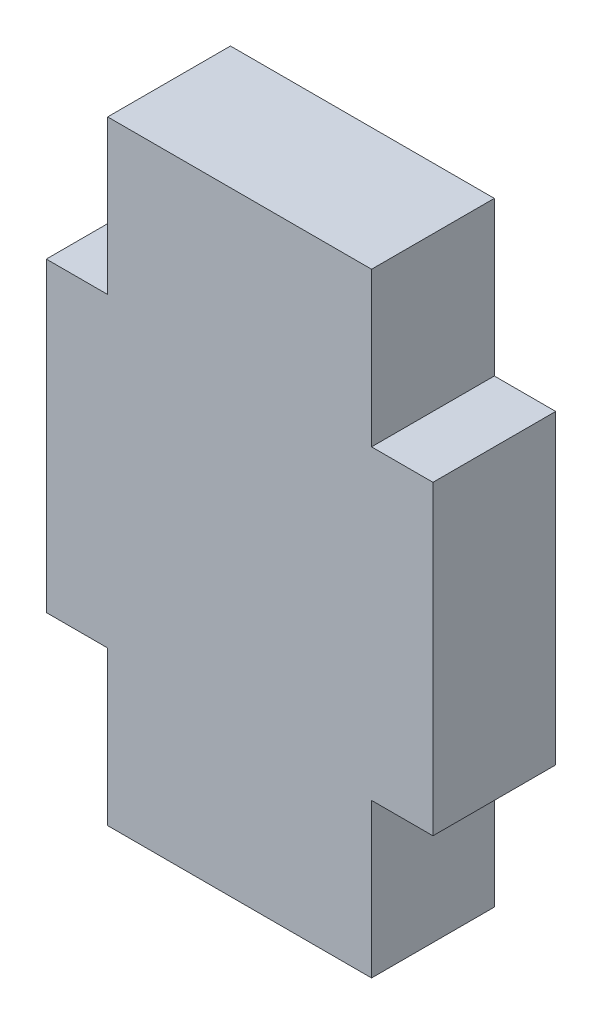
ISO-10303-21;
HEADER;
FILE_DESCRIPTION(('STEP AP214'),'2;1');
FILE_NAME('part.step','',(''),(''),'','','');
FILE_SCHEMA(('AUTOMOTIVE_DESIGN { 1 0 10303 214 1 1 1 1 }'));
ENDSEC;
DATA;
#1=APPLICATION_CONTEXT('core data for automotive mechanical design processes');
#2=APPLICATION_PROTOCOL_DEFINITION('international standard','automotive_design',2000,#1);
#3=PRODUCT_CONTEXT('',#1,'mechanical');
#4=PRODUCT('Part','Part','',(#3));
#5=PRODUCT_RELATED_PRODUCT_CATEGORY('part','',(#4));
#6=PRODUCT_DEFINITION_FORMATION('','',#4);
#7=PRODUCT_DEFINITION_CONTEXT('part definition',#1,'design');
#8=PRODUCT_DEFINITION('design','',#6,#7);
#9=PRODUCT_DEFINITION_SHAPE('','',#8);
#10=(LENGTH_UNIT() NAMED_UNIT(*) SI_UNIT(.MILLI.,.METRE.));
#11=(NAMED_UNIT(*) PLANE_ANGLE_UNIT() SI_UNIT($,.RADIAN.));
#12=(NAMED_UNIT(*) SI_UNIT($,.STERADIAN.) SOLID_ANGLE_UNIT());
#13=UNCERTAINTY_MEASURE_WITH_UNIT(LENGTH_MEASURE(1.E-05),#10,'distance_accuracy_value','');
#14=(GEOMETRIC_REPRESENTATION_CONTEXT(3) GLOBAL_UNCERTAINTY_ASSIGNED_CONTEXT((#13)) GLOBAL_UNIT_ASSIGNED_CONTEXT((#10,
#11,#12)) REPRESENTATION_CONTEXT('',''));
#15=CARTESIAN_POINT('',(0.,0.,0.));
#16=DIRECTION('',(0.,0.,1.));
#17=DIRECTION('',(1.,0.,0.));
#18=AXIS2_PLACEMENT_3D('',#15,#16,#17);
#19=CARTESIAN_POINT('',(-17.524,80.0070946012342,5.08));
#20=DIRECTION('',(1.,0.,0.));
#21=DIRECTION('',(0.,0.,-1.));
#22=AXIS2_PLACEMENT_3D('',#19,#20,#21);
#23=PLANE('',#22);
#24=DIRECTION('',(0.,-1.,0.));
#25=VECTOR('',#24,1.);
#26=CARTESIAN_POINT('',(-17.524,80.0070946012342,0.));
#27=LINE('',#26,#25);
#28=CARTESIAN_POINT('',(-17.524,80.0070946012342,0.));
#29=VERTEX_POINT('',#28);
#30=CARTESIAN_POINT('',(-17.524,73.6414919451062,0.));
#31=VERTEX_POINT('',#30);
#32=EDGE_CURVE('E153',#29,#31,#27,.T.);
#33=ORIENTED_EDGE('',*,*,#32,.T.);
#34=DIRECTION('',(0.,0.,-1.));
#35=VECTOR('',#34,1.);
#36=CARTESIAN_POINT('',(-17.524,73.6414919451062,5.08));
#37=LINE('',#36,#35);
#38=CARTESIAN_POINT('',(-17.524,73.6414919451062,5.08));
#39=VERTEX_POINT('',#38);
#40=EDGE_CURVE('E11',#39,#31,#37,.T.);
#41=ORIENTED_EDGE('',*,*,#40,.F.);
#42=DIRECTION('',(0.,-1.,0.));
#43=VECTOR('',#42,1.);
#44=CARTESIAN_POINT('',(-17.524,80.0070946012342,5.08));
#45=LINE('',#44,#43);
#46=CARTESIAN_POINT('',(-17.524,80.0070946012342,5.08));
#47=VERTEX_POINT('',#46);
#48=EDGE_CURVE('E175',#47,#39,#45,.T.);
#49=ORIENTED_EDGE('',*,*,#48,.F.);
#50=DIRECTION('',(0.,0.,-1.));
#51=VECTOR('',#50,1.);
#52=CARTESIAN_POINT('',(-17.524,80.0070946012342,5.08));
#53=LINE('',#52,#51);
#54=EDGE_CURVE('E149',#47,#29,#53,.T.);
#55=ORIENTED_EDGE('',*,*,#54,.T.);
#56=EDGE_LOOP('',(#33,#41,#49,#55));
#57=FACE_BOUND('',#56,.T.);
#58=ADVANCED_FACE('F33',(#57),#23,.F.);
#59=CARTESIAN_POINT('',(-17.524,73.6414919451062,5.08));
#60=DIRECTION('',(0.,1.,0.));
#61=DIRECTION('',(0.,0.,1.));
#62=AXIS2_PLACEMENT_3D('',#59,#60,#61);
#63=PLANE('',#62);
#64=DIRECTION('',(1.,0.,0.));
#65=VECTOR('',#64,1.);
#66=CARTESIAN_POINT('',(-17.524,73.6414919451062,0.));
#67=LINE('',#66,#65);
#68=CARTESIAN_POINT('',(-6.604,73.6414919451062,0.));
#69=VERTEX_POINT('',#68);
#70=EDGE_CURVE('E156',#31,#69,#67,.T.);
#71=ORIENTED_EDGE('',*,*,#70,.T.);
#72=DIRECTION('',(0.,0.,-1.));
#73=VECTOR('',#72,1.);
#74=CARTESIAN_POINT('',(-6.604,73.6414919451062,5.08));
#75=LINE('',#74,#73);
#76=CARTESIAN_POINT('',(-6.604,73.6414919451062,5.08));
#77=VERTEX_POINT('',#76);
#78=EDGE_CURVE('E41',#77,#69,#75,.T.);
#79=ORIENTED_EDGE('',*,*,#78,.F.);
#80=DIRECTION('',(1.,0.,0.));
#81=VECTOR('',#80,1.);
#82=CARTESIAN_POINT('',(-17.524,73.6414919451062,5.08));
#83=LINE('',#82,#81);
#84=EDGE_CURVE('E104',#39,#77,#83,.T.);
#85=ORIENTED_EDGE('',*,*,#84,.F.);
#86=ORIENTED_EDGE('',*,*,#40,.T.);
#87=EDGE_LOOP('',(#71,#79,#85,#86));
#88=FACE_BOUND('',#87,.T.);
#89=ADVANCED_FACE('F253',(#88),#63,.F.);
#90=CARTESIAN_POINT('',(-6.604,73.6414919451062,5.08));
#91=DIRECTION('',(-1.,0.,0.));
#92=DIRECTION('',(0.,0.,1.));
#93=AXIS2_PLACEMENT_3D('',#90,#91,#92);
#94=PLANE('',#93);
#95=DIRECTION('',(0.,1.,0.));
#96=VECTOR('',#95,1.);
#97=CARTESIAN_POINT('',(-6.604,73.6414919451062,0.));
#98=LINE('',#97,#96);
#99=CARTESIAN_POINT('',(-6.604,80.0070946012342,0.));
#100=VERTEX_POINT('',#99);
#101=EDGE_CURVE('E158',#69,#100,#98,.T.);
#102=ORIENTED_EDGE('',*,*,#101,.T.);
#103=DIRECTION('',(0.,0.,-1.));
#104=VECTOR('',#103,1.);
#105=CARTESIAN_POINT('',(-6.604,80.0070946012342,5.08));
#106=LINE('',#105,#104);
#107=CARTESIAN_POINT('',(-6.604,80.0070946012342,5.08));
#108=VERTEX_POINT('',#107);
#109=EDGE_CURVE('E194',#108,#100,#106,.T.);
#110=ORIENTED_EDGE('',*,*,#109,.F.);
#111=DIRECTION('',(0.,1.,0.));
#112=VECTOR('',#111,1.);
#113=CARTESIAN_POINT('',(-6.604,73.6414919451062,5.08));
#114=LINE('',#113,#112);
#115=EDGE_CURVE('E202',#77,#108,#114,.T.);
#116=ORIENTED_EDGE('',*,*,#115,.F.);
#117=ORIENTED_EDGE('',*,*,#78,.T.);
#118=EDGE_LOOP('',(#102,#110,#116,#117));
#119=FACE_BOUND('',#118,.T.);
#120=ADVANCED_FACE('F200',(#119),#94,.F.);
#121=CARTESIAN_POINT('',(-6.604,80.0070946012342,5.08));
#122=DIRECTION('',(0.,1.,0.));
#123=DIRECTION('',(0.,0.,1.));
#124=AXIS2_PLACEMENT_3D('',#121,#122,#123);
#125=PLANE('',#124);
#126=DIRECTION('',(1.,0.,0.));
#127=VECTOR('',#126,1.);
#128=CARTESIAN_POINT('',(-6.604,80.0070946012342,0.));
#129=LINE('',#128,#127);
#130=CARTESIAN_POINT('',(-4.064,80.0070946012342,0.));
#131=VERTEX_POINT('',#130);
#132=EDGE_CURVE('E160',#100,#131,#129,.T.);
#133=ORIENTED_EDGE('',*,*,#132,.T.);
#134=DIRECTION('',(0.,0.,-1.));
#135=VECTOR('',#134,1.);
#136=CARTESIAN_POINT('',(-4.064,80.0070946012342,5.08));
#137=LINE('',#136,#135);
#138=CARTESIAN_POINT('',(-4.064,80.0070946012342,5.08));
#139=VERTEX_POINT('',#138);
#140=EDGE_CURVE('E191',#139,#131,#137,.T.);
#141=ORIENTED_EDGE('',*,*,#140,.F.);
#142=DIRECTION('',(1.,0.,0.));
#143=VECTOR('',#142,1.);
#144=CARTESIAN_POINT('',(-6.604,80.0070946012342,5.08));
#145=LINE('',#144,#143);
#146=EDGE_CURVE('E220',#108,#139,#145,.T.);
#147=ORIENTED_EDGE('',*,*,#146,.F.);
#148=ORIENTED_EDGE('',*,*,#109,.T.);
#149=EDGE_LOOP('',(#133,#141,#147,#148));
#150=FACE_BOUND('',#149,.T.);
#151=ADVANCED_FACE('F211',(#150),#125,.F.);
#152=CARTESIAN_POINT('',(-4.064,80.0070946012342,5.08));
#153=DIRECTION('',(-1.,0.,0.));
#154=DIRECTION('',(0.,0.,1.));
#155=AXIS2_PLACEMENT_3D('',#152,#153,#154);
#156=PLANE('',#155);
#157=DIRECTION('',(0.,1.,0.));
#158=VECTOR('',#157,1.);
#159=CARTESIAN_POINT('',(-4.064,80.0070946012342,0.));
#160=LINE('',#159,#158);
#161=CARTESIAN_POINT('',(-4.064,92.6758892889782,0.));
#162=VERTEX_POINT('',#161);
#163=EDGE_CURVE('E162',#131,#162,#160,.T.);
#164=ORIENTED_EDGE('',*,*,#163,.T.);
#165=DIRECTION('',(0.,0.,-1.));
#166=VECTOR('',#165,1.);
#167=CARTESIAN_POINT('',(-4.064,92.6758892889782,5.08));
#168=LINE('',#167,#166);
#169=CARTESIAN_POINT('',(-4.064,92.6758892889782,5.08));
#170=VERTEX_POINT('',#169);
#171=EDGE_CURVE('E188',#170,#162,#168,.T.);
#172=ORIENTED_EDGE('',*,*,#171,.F.);
#173=DIRECTION('',(0.,1.,0.));
#174=VECTOR('',#173,1.);
#175=CARTESIAN_POINT('',(-4.064,80.0070946012342,5.08));
#176=LINE('',#175,#174);
#177=EDGE_CURVE('E217',#139,#170,#176,.T.);
#178=ORIENTED_EDGE('',*,*,#177,.F.);
#179=ORIENTED_EDGE('',*,*,#140,.T.);
#180=EDGE_LOOP('',(#164,#172,#178,#179));
#181=FACE_BOUND('',#180,.T.);
#182=ADVANCED_FACE('F215',(#181),#156,.F.);
#183=CARTESIAN_POINT('',(-6.604,92.6758892889782,5.08));
#184=DIRECTION('',(0.,-1.,0.));
#185=DIRECTION('',(0.,0.,-1.));
#186=AXIS2_PLACEMENT_3D('',#183,#184,#185);
#187=PLANE('',#186);
#188=DIRECTION('',(-1.,0.,0.));
#189=VECTOR('',#188,1.);
#190=CARTESIAN_POINT('',(-6.604,92.6758892889782,0.));
#191=LINE('',#190,#189);
#192=CARTESIAN_POINT('',(-6.604,92.6758892889782,0.));
#193=VERTEX_POINT('',#192);
#194=EDGE_CURVE('E164',#162,#193,#191,.T.);
#195=ORIENTED_EDGE('',*,*,#194,.T.);
#196=DIRECTION('',(0.,0.,-1.));
#197=VECTOR('',#196,1.);
#198=CARTESIAN_POINT('',(-6.604,92.6758892889782,5.08));
#199=LINE('',#198,#197);
#200=CARTESIAN_POINT('',(-6.604,92.6758892889782,5.08));
#201=VERTEX_POINT('',#200);
#202=EDGE_CURVE('E185',#201,#193,#199,.T.);
#203=ORIENTED_EDGE('',*,*,#202,.F.);
#204=DIRECTION('',(-1.,0.,0.));
#205=VECTOR('',#204,1.);
#206=CARTESIAN_POINT('',(-6.604,92.6758892889782,5.08));
#207=LINE('',#206,#205);
#208=EDGE_CURVE('E219',#170,#201,#207,.T.);
#209=ORIENTED_EDGE('',*,*,#208,.F.);
#210=ORIENTED_EDGE('',*,*,#171,.T.);
#211=EDGE_LOOP('',(#195,#203,#209,#210));
#212=FACE_BOUND('',#211,.T.);
#213=ADVANCED_FACE('F266',(#212),#187,.F.);
#214=CARTESIAN_POINT('',(-6.604,92.6758892889782,5.08));
#215=DIRECTION('',(-1.,0.,0.));
#216=DIRECTION('',(0.,0.,1.));
#217=AXIS2_PLACEMENT_3D('',#214,#215,#216);
#218=PLANE('',#217);
#219=DIRECTION('',(0.,1.,0.));
#220=VECTOR('',#219,1.);
#221=CARTESIAN_POINT('',(-6.604,92.6758892889782,0.));
#222=LINE('',#221,#220);
#223=CARTESIAN_POINT('',(-6.604,99.0414919451063,0.));
#224=VERTEX_POINT('',#223);
#225=EDGE_CURVE('E166',#193,#224,#222,.T.);
#226=ORIENTED_EDGE('',*,*,#225,.T.);
#227=DIRECTION('',(0.,0.,-1.));
#228=VECTOR('',#227,1.);
#229=CARTESIAN_POINT('',(-6.604,99.0414919451063,5.08));
#230=LINE('',#229,#228);
#231=CARTESIAN_POINT('',(-6.604,99.0414919451063,5.08));
#232=VERTEX_POINT('',#231);
#233=EDGE_CURVE('E182',#232,#224,#230,.T.);
#234=ORIENTED_EDGE('',*,*,#233,.F.);
#235=DIRECTION('',(0.,1.,0.));
#236=VECTOR('',#235,1.);
#237=CARTESIAN_POINT('',(-6.604,92.6758892889782,5.08));
#238=LINE('',#237,#236);
#239=EDGE_CURVE('E222',#201,#232,#238,.T.);
#240=ORIENTED_EDGE('',*,*,#239,.F.);
#241=ORIENTED_EDGE('',*,*,#202,.T.);
#242=EDGE_LOOP('',(#226,#234,#240,#241));
#243=FACE_BOUND('',#242,.T.);
#244=ADVANCED_FACE('F269',(#243),#218,.F.);
#245=CARTESIAN_POINT('',(-17.524,99.0414919451063,5.08));
#246=DIRECTION('',(0.,-1.,0.));
#247=DIRECTION('',(0.,0.,-1.));
#248=AXIS2_PLACEMENT_3D('',#245,#246,#247);
#249=PLANE('',#248);
#250=DIRECTION('',(-1.,0.,0.));
#251=VECTOR('',#250,1.);
#252=CARTESIAN_POINT('',(-17.524,99.0414919451063,0.));
#253=LINE('',#252,#251);
#254=CARTESIAN_POINT('',(-17.524,99.0414919451063,0.));
#255=VERTEX_POINT('',#254);
#256=EDGE_CURVE('E168',#224,#255,#253,.T.);
#257=ORIENTED_EDGE('',*,*,#256,.T.);
#258=DIRECTION('',(0.,0.,-1.));
#259=VECTOR('',#258,1.);
#260=CARTESIAN_POINT('',(-17.524,99.0414919451063,5.08));
#261=LINE('',#260,#259);
#262=CARTESIAN_POINT('',(-17.524,99.0414919451063,5.08));
#263=VERTEX_POINT('',#262);
#264=EDGE_CURVE('E179',#263,#255,#261,.T.);
#265=ORIENTED_EDGE('',*,*,#264,.F.);
#266=DIRECTION('',(-1.,0.,0.));
#267=VECTOR('',#266,1.);
#268=CARTESIAN_POINT('',(-17.524,99.0414919451063,5.08));
#269=LINE('',#268,#267);
#270=EDGE_CURVE('E228',#232,#263,#269,.T.);
#271=ORIENTED_EDGE('',*,*,#270,.F.);
#272=ORIENTED_EDGE('',*,*,#233,.T.);
#273=EDGE_LOOP('',(#257,#265,#271,#272));
#274=FACE_BOUND('',#273,.T.);
#275=ADVANCED_FACE('F234',(#274),#249,.F.);
#276=CARTESIAN_POINT('',(-17.524,99.0414919451063,5.08));
#277=DIRECTION('',(1.,0.,0.));
#278=DIRECTION('',(0.,0.,-1.));
#279=AXIS2_PLACEMENT_3D('',#276,#277,#278);
#280=PLANE('',#279);
#281=DIRECTION('',(0.,-1.,0.));
#282=VECTOR('',#281,1.);
#283=CARTESIAN_POINT('',(-17.524,99.0414919451063,0.));
#284=LINE('',#283,#282);
#285=CARTESIAN_POINT('',(-17.524,92.6758892889782,0.));
#286=VERTEX_POINT('',#285);
#287=EDGE_CURVE('E170',#255,#286,#284,.T.);
#288=ORIENTED_EDGE('',*,*,#287,.T.);
#289=DIRECTION('',(0.,0.,-1.));
#290=VECTOR('',#289,1.);
#291=CARTESIAN_POINT('',(-17.524,92.6758892889782,5.08));
#292=LINE('',#291,#290);
#293=CARTESIAN_POINT('',(-17.524,92.6758892889782,5.08));
#294=VERTEX_POINT('',#293);
#295=EDGE_CURVE('E144',#294,#286,#292,.T.);
#296=ORIENTED_EDGE('',*,*,#295,.F.);
#297=DIRECTION('',(0.,-1.,0.));
#298=VECTOR('',#297,1.);
#299=CARTESIAN_POINT('',(-17.524,99.0414919451063,5.08));
#300=LINE('',#299,#298);
#301=EDGE_CURVE('E135',#263,#294,#300,.T.);
#302=ORIENTED_EDGE('',*,*,#301,.F.);
#303=ORIENTED_EDGE('',*,*,#264,.T.);
#304=EDGE_LOOP('',(#288,#296,#302,#303));
#305=FACE_BOUND('',#304,.T.);
#306=ADVANCED_FACE('F238',(#305),#280,.F.);
#307=CARTESIAN_POINT('',(-17.524,92.6758892889782,5.08));
#308=DIRECTION('',(0.,-1.,0.));
#309=DIRECTION('',(0.,0.,-1.));
#310=AXIS2_PLACEMENT_3D('',#307,#308,#309);
#311=PLANE('',#310);
#312=DIRECTION('',(-1.,0.,0.));
#313=VECTOR('',#312,1.);
#314=CARTESIAN_POINT('',(-17.524,92.6758892889782,0.));
#315=LINE('',#314,#313);
#316=CARTESIAN_POINT('',(-20.064,92.6758892889782,0.));
#317=VERTEX_POINT('',#316);
#318=EDGE_CURVE('E143',#286,#317,#315,.T.);
#319=ORIENTED_EDGE('',*,*,#318,.T.);
#320=DIRECTION('',(0.,0.,-1.));
#321=VECTOR('',#320,1.);
#322=CARTESIAN_POINT('',(-20.064,92.6758892889782,5.08));
#323=LINE('',#322,#321);
#324=CARTESIAN_POINT('',(-20.064,92.6758892889782,5.08));
#325=VERTEX_POINT('',#324);
#326=EDGE_CURVE('E140',#325,#317,#323,.T.);
#327=ORIENTED_EDGE('',*,*,#326,.F.);
#328=DIRECTION('',(-1.,0.,0.));
#329=VECTOR('',#328,1.);
#330=CARTESIAN_POINT('',(-17.524,92.6758892889782,5.08));
#331=LINE('',#330,#329);
#332=EDGE_CURVE('E129',#294,#325,#331,.T.);
#333=ORIENTED_EDGE('',*,*,#332,.F.);
#334=ORIENTED_EDGE('',*,*,#295,.T.);
#335=EDGE_LOOP('',(#319,#327,#333,#334));
#336=FACE_BOUND('',#335,.T.);
#337=ADVANCED_FACE('F141',(#336),#311,.F.);
#338=CARTESIAN_POINT('',(-20.064,92.6758892889782,5.08));
#339=DIRECTION('',(1.,0.,0.));
#340=DIRECTION('',(0.,0.,-1.));
#341=AXIS2_PLACEMENT_3D('',#338,#339,#340);
#342=PLANE('',#341);
#343=DIRECTION('',(0.,-1.,0.));
#344=VECTOR('',#343,1.);
#345=CARTESIAN_POINT('',(-20.064,92.6758892889782,0.));
#346=LINE('',#345,#344);
#347=CARTESIAN_POINT('',(-20.064,80.0070946012342,0.));
#348=VERTEX_POINT('',#347);
#349=EDGE_CURVE('E90',#317,#348,#346,.T.);
#350=ORIENTED_EDGE('',*,*,#349,.T.);
#351=DIRECTION('',(0.,0.,-1.));
#352=VECTOR('',#351,1.);
#353=CARTESIAN_POINT('',(-20.064,80.0070946012342,5.08));
#354=LINE('',#353,#352);
#355=CARTESIAN_POINT('',(-20.064,80.0070946012342,5.08));
#356=VERTEX_POINT('',#355);
#357=EDGE_CURVE('E145',#356,#348,#354,.T.);
#358=ORIENTED_EDGE('',*,*,#357,.F.);
#359=DIRECTION('',(0.,-1.,0.));
#360=VECTOR('',#359,1.);
#361=CARTESIAN_POINT('',(-20.064,92.6758892889782,5.08));
#362=LINE('',#361,#360);
#363=EDGE_CURVE('E133',#325,#356,#362,.T.);
#364=ORIENTED_EDGE('',*,*,#363,.F.);
#365=ORIENTED_EDGE('',*,*,#326,.T.);
#366=EDGE_LOOP('',(#350,#358,#364,#365));
#367=FACE_BOUND('',#366,.T.);
#368=ADVANCED_FACE('F147',(#367),#342,.F.);
#369=CARTESIAN_POINT('',(-17.524,80.0070946012342,5.08));
#370=DIRECTION('',(0.,1.,0.));
#371=DIRECTION('',(0.,0.,1.));
#372=AXIS2_PLACEMENT_3D('',#369,#370,#371);
#373=PLANE('',#372);
#374=DIRECTION('',(1.,0.,0.));
#375=VECTOR('',#374,1.);
#376=CARTESIAN_POINT('',(-17.524,80.0070946012342,0.));
#377=LINE('',#376,#375);
#378=EDGE_CURVE('E96',#348,#29,#377,.T.);
#379=ORIENTED_EDGE('',*,*,#378,.T.);
#380=ORIENTED_EDGE('',*,*,#54,.F.);
#381=DIRECTION('',(1.,0.,0.));
#382=VECTOR('',#381,1.);
#383=CARTESIAN_POINT('',(-17.524,80.0070946012342,5.08));
#384=LINE('',#383,#382);
#385=EDGE_CURVE('E49',#356,#47,#384,.T.);
#386=ORIENTED_EDGE('',*,*,#385,.F.);
#387=ORIENTED_EDGE('',*,*,#357,.T.);
#388=EDGE_LOOP('',(#379,#380,#386,#387));
#389=FACE_BOUND('',#388,.T.);
#390=ADVANCED_FACE('F242',(#389),#373,.F.);
#391=CARTESIAN_POINT('',(0.,0.,5.08));
#392=DIRECTION('',(0.,0.,1.));
#393=DIRECTION('',(1.,0.,0.));
#394=AXIS2_PLACEMENT_3D('',#391,#392,#393);
#395=PLANE('',#394);
#396=ORIENTED_EDGE('',*,*,#48,.T.);
#397=ORIENTED_EDGE('',*,*,#84,.T.);
#398=ORIENTED_EDGE('',*,*,#115,.T.);
#399=ORIENTED_EDGE('',*,*,#146,.T.);
#400=ORIENTED_EDGE('',*,*,#177,.T.);
#401=ORIENTED_EDGE('',*,*,#208,.T.);
#402=ORIENTED_EDGE('',*,*,#239,.T.);
#403=ORIENTED_EDGE('',*,*,#270,.T.);
#404=ORIENTED_EDGE('',*,*,#301,.T.);
#405=ORIENTED_EDGE('',*,*,#332,.T.);
#406=ORIENTED_EDGE('',*,*,#363,.T.);
#407=ORIENTED_EDGE('',*,*,#385,.T.);
#408=EDGE_LOOP('',(#396,#397,#398,#399,#400,#401,#402,#403,#404,#405,#406,#407));
#409=FACE_BOUND('',#408,.T.);
#410=ADVANCED_FACE('F131',(#409),#395,.T.);
#411=CARTESIAN_POINT('',(0.,0.,0.));
#412=DIRECTION('',(0.,0.,1.));
#413=DIRECTION('',(1.,0.,0.));
#414=AXIS2_PLACEMENT_3D('',#411,#412,#413);
#415=PLANE('',#414);
#416=ORIENTED_EDGE('',*,*,#32,.F.);
#417=ORIENTED_EDGE('',*,*,#378,.F.);
#418=ORIENTED_EDGE('',*,*,#349,.F.);
#419=ORIENTED_EDGE('',*,*,#318,.F.);
#420=ORIENTED_EDGE('',*,*,#287,.F.);
#421=ORIENTED_EDGE('',*,*,#256,.F.);
#422=ORIENTED_EDGE('',*,*,#225,.F.);
#423=ORIENTED_EDGE('',*,*,#194,.F.);
#424=ORIENTED_EDGE('',*,*,#163,.F.);
#425=ORIENTED_EDGE('',*,*,#132,.F.);
#426=ORIENTED_EDGE('',*,*,#101,.F.);
#427=ORIENTED_EDGE('',*,*,#70,.F.);
#428=EDGE_LOOP('',(#416,#417,#418,#419,#420,#421,#422,#423,#424,#425,#426,#427));
#429=FACE_BOUND('',#428,.T.);
#430=ADVANCED_FACE('F206',(#429),#415,.F.);
#431=CLOSED_SHELL('',(#58,#89,#120,#151,#182,#213,#244,#275,#306,#337,#368,#390,#410,#430));
#432=MANIFOLD_SOLID_BREP('B2',#431);
#433=ADVANCED_BREP_SHAPE_REPRESENTATION('',(#18,#432),#14);
#434=SHAPE_DEFINITION_REPRESENTATION(#9,#433);
ENDSEC;
END-ISO-10303-21;
